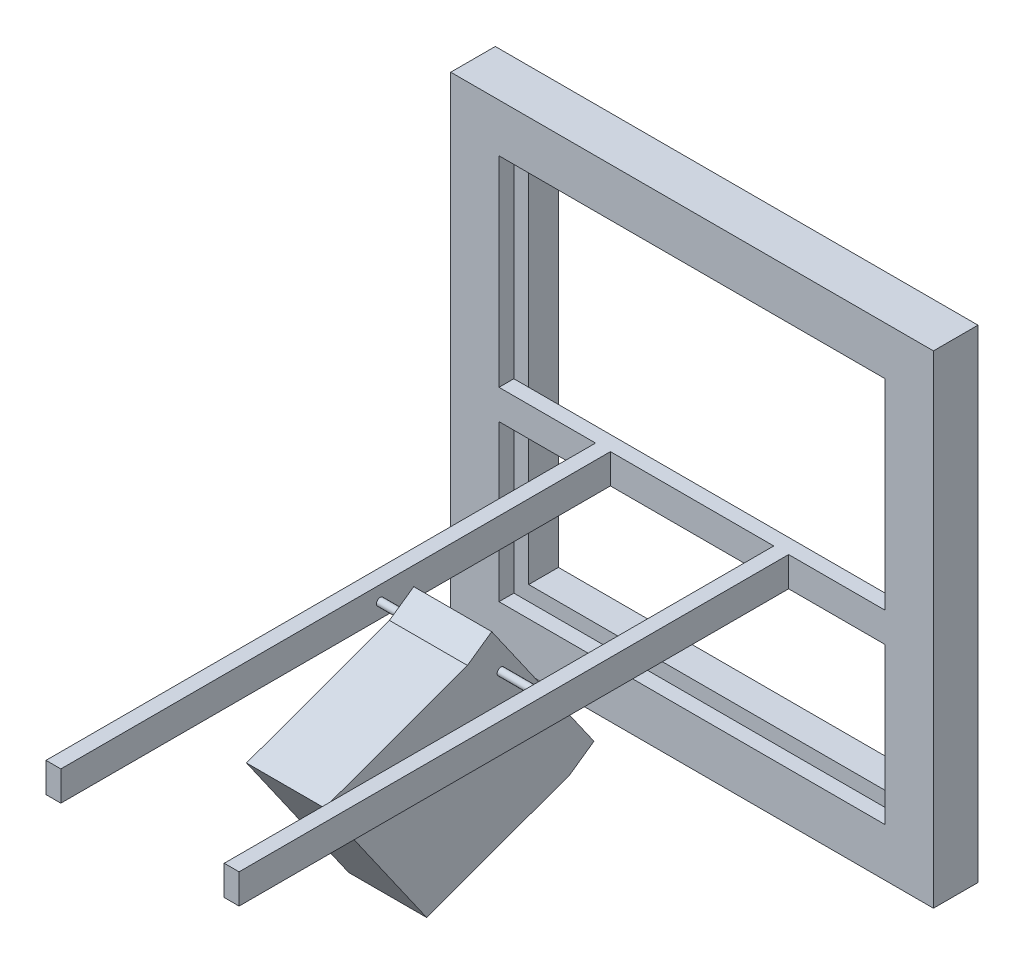
ISO-10303-21;
HEADER;
FILE_DESCRIPTION(('STEP AP214'),'2;1');
FILE_NAME('part.step','',(''),(''),'','','');
FILE_SCHEMA(('AUTOMOTIVE_DESIGN { 1 0 10303 214 1 1 1 1 }'));
ENDSEC;
DATA;
#1=APPLICATION_CONTEXT('core data for automotive mechanical design processes');
#2=APPLICATION_PROTOCOL_DEFINITION('international standard','automotive_design',2000,#1);
#3=PRODUCT_CONTEXT('',#1,'mechanical');
#4=PRODUCT('Part','Part','',(#3));
#5=PRODUCT_RELATED_PRODUCT_CATEGORY('part','',(#4));
#6=PRODUCT_DEFINITION_FORMATION('','',#4);
#7=PRODUCT_DEFINITION_CONTEXT('part definition',#1,'design');
#8=PRODUCT_DEFINITION('design','',#6,#7);
#9=PRODUCT_DEFINITION_SHAPE('','',#8);
#10=(LENGTH_UNIT() NAMED_UNIT(*) SI_UNIT(.MILLI.,.METRE.));
#11=(NAMED_UNIT(*) PLANE_ANGLE_UNIT() SI_UNIT($,.RADIAN.));
#12=(NAMED_UNIT(*) SI_UNIT($,.STERADIAN.) SOLID_ANGLE_UNIT());
#13=UNCERTAINTY_MEASURE_WITH_UNIT(LENGTH_MEASURE(1.E-05),#10,'distance_accuracy_value','');
#14=(GEOMETRIC_REPRESENTATION_CONTEXT(3) GLOBAL_UNCERTAINTY_ASSIGNED_CONTEXT((#13)) GLOBAL_UNIT_ASSIGNED_CONTEXT((#10,
#11,#12)) REPRESENTATION_CONTEXT('',''));
#15=CARTESIAN_POINT('',(0.,0.,0.));
#16=DIRECTION('',(0.,0.,1.));
#17=DIRECTION('',(1.,0.,0.));
#18=AXIS2_PLACEMENT_3D('',#15,#16,#17);
#19=CARTESIAN_POINT('',(186.944,292.1,469.9));
#20=DIRECTION('',(1.,0.,0.));
#21=DIRECTION('',(0.,0.,-1.));
#22=AXIS2_PLACEMENT_3D('',#19,#20,#21);
#23=CYLINDRICAL_SURFACE('',#22,6.34999999999994);
#24=CARTESIAN_POINT('',(469.9,292.1,469.9));
#25=DIRECTION('',(1.,0.,0.));
#26=DIRECTION('',(0.,0.,-1.));
#27=AXIS2_PLACEMENT_3D('',#24,#25,#26);
#28=CIRCLE('',#27,6.34999999999994);
#29=CARTESIAN_POINT('',(469.9,292.1,463.55));
#30=VERTEX_POINT('',#29);
#31=EDGE_CURVE('E367',#30,#30,#28,.F.);
#32=ORIENTED_EDGE('',*,*,#31,.T.);
#33=EDGE_LOOP('',(#32));
#34=FACE_BOUND('',#33,.T.);
#35=CARTESIAN_POINT('',(396.875,292.1,469.9));
#36=DIRECTION('',(-1.,0.,0.));
#37=DIRECTION('',(0.,0.,1.));
#38=AXIS2_PLACEMENT_3D('',#35,#36,#37);
#39=CIRCLE('',#38,6.34999999999994);
#40=CARTESIAN_POINT('',(396.875,292.1,476.25));
#41=VERTEX_POINT('',#40);
#42=EDGE_CURVE('E11',#41,#41,#39,.T.);
#43=ORIENTED_EDGE('',*,*,#42,.F.);
#44=EDGE_LOOP('',(#43));
#45=FACE_BOUND('',#44,.T.);
#46=ADVANCED_FACE('F41',(#34,#45),#23,.T.);
#47=CARTESIAN_POINT('',(0.,0.,76.2));
#48=DIRECTION('',(0.,0.,1.));
#49=DIRECTION('',(1.,0.,0.));
#50=AXIS2_PLACEMENT_3D('',#47,#48,#49);
#51=PLANE('',#50);
#52=DIRECTION('',(1.,0.,0.));
#53=VECTOR('',#52,1.);
#54=CARTESIAN_POINT('',(0.,266.7,76.2));
#55=LINE('',#54,#53);
#56=CARTESIAN_POINT('',(190.5,266.7,76.2));
#57=VERTEX_POINT('',#56);
#58=CARTESIAN_POINT('',(469.9,266.7,76.2));
#59=VERTEX_POINT('',#58);
#60=EDGE_CURVE('E423',#57,#59,#55,.T.);
#61=ORIENTED_EDGE('',*,*,#60,.T.);
#62=DIRECTION('',(0.,-1.,0.));
#63=VECTOR('',#62,1.);
#64=CARTESIAN_POINT('',(469.9,317.5,76.2));
#65=LINE('',#64,#63);
#66=CARTESIAN_POINT('',(469.9,317.5,76.2));
#67=VERTEX_POINT('',#66);
#68=EDGE_CURVE('E381',#67,#59,#65,.T.);
#69=ORIENTED_EDGE('',*,*,#68,.F.);
#70=DIRECTION('',(-1.,0.,0.));
#71=VECTOR('',#70,1.);
#72=CARTESIAN_POINT('',(0.,317.5,76.2));
#73=LINE('',#72,#71);
#74=CARTESIAN_POINT('',(190.5,317.5,76.2));
#75=VERTEX_POINT('',#74);
#76=EDGE_CURVE('E427',#67,#75,#73,.T.);
#77=ORIENTED_EDGE('',*,*,#76,.T.);
#78=DIRECTION('',(0.,1.,0.));
#79=VECTOR('',#78,1.);
#80=CARTESIAN_POINT('',(190.5,317.5,76.2));
#81=LINE('',#80,#79);
#82=EDGE_CURVE('E397',#57,#75,#81,.T.);
#83=ORIENTED_EDGE('',*,*,#82,.F.);
#84=EDGE_LOOP('',(#61,#69,#77,#83));
#85=FACE_BOUND('',#84,.T.);
#86=ADVANCED_FACE('F549',(#85),#51,.T.);
#87=DIRECTION('',(0.,-1.,0.));
#88=VECTOR('',#87,1.);
#89=CARTESIAN_POINT('',(165.1,317.5,76.2));
#90=LINE('',#89,#88);
#91=CARTESIAN_POINT('',(165.1,317.5,76.2));
#92=VERTEX_POINT('',#91);
#93=CARTESIAN_POINT('',(165.1,266.7,76.2));
#94=VERTEX_POINT('',#93);
#95=EDGE_CURVE('E385',#92,#94,#90,.T.);
#96=ORIENTED_EDGE('',*,*,#95,.F.);
#97=CARTESIAN_POINT('',(0.,317.5,76.2));
#98=VERTEX_POINT('',#97);
#99=EDGE_CURVE('E422',#92,#98,#73,.T.);
#100=ORIENTED_EDGE('',*,*,#99,.T.);
#101=DIRECTION('',(0.,-1.,0.));
#102=VECTOR('',#101,1.);
#103=CARTESIAN_POINT('',(0.,660.4,76.2));
#104=LINE('',#103,#102);
#105=CARTESIAN_POINT('',(0.,660.4,76.2));
#106=VERTEX_POINT('',#105);
#107=EDGE_CURVE('E259',#106,#98,#104,.T.);
#108=ORIENTED_EDGE('',*,*,#107,.F.);
#109=DIRECTION('',(-1.,0.,0.));
#110=VECTOR('',#109,1.);
#111=CARTESIAN_POINT('',(0.,660.4,76.2));
#112=LINE('',#111,#110);
#113=CARTESIAN_POINT('',(660.4,660.4,76.2));
#114=VERTEX_POINT('',#113);
#115=EDGE_CURVE('E279',#114,#106,#112,.T.);
#116=ORIENTED_EDGE('',*,*,#115,.F.);
#117=DIRECTION('',(0.,1.,0.));
#118=VECTOR('',#117,1.);
#119=CARTESIAN_POINT('',(660.4,660.4,76.2));
#120=LINE('',#119,#118);
#121=CARTESIAN_POINT('',(660.4,317.5,76.2));
#122=VERTEX_POINT('',#121);
#123=EDGE_CURVE('E275',#122,#114,#120,.T.);
#124=ORIENTED_EDGE('',*,*,#123,.F.);
#125=CARTESIAN_POINT('',(495.3,317.5,76.2));
#126=VERTEX_POINT('',#125);
#127=EDGE_CURVE('E56',#122,#126,#73,.T.);
#128=ORIENTED_EDGE('',*,*,#127,.T.);
#129=DIRECTION('',(0.,1.,0.));
#130=VECTOR('',#129,1.);
#131=CARTESIAN_POINT('',(495.3,317.5,76.2));
#132=LINE('',#131,#130);
#133=CARTESIAN_POINT('',(495.3,266.7,76.2));
#134=VERTEX_POINT('',#133);
#135=EDGE_CURVE('E60',#134,#126,#132,.T.);
#136=ORIENTED_EDGE('',*,*,#135,.F.);
#137=CARTESIAN_POINT('',(660.4,266.7,76.2));
#138=VERTEX_POINT('',#137);
#139=EDGE_CURVE('E424',#134,#138,#55,.T.);
#140=ORIENTED_EDGE('',*,*,#139,.T.);
#141=CARTESIAN_POINT('',(660.4,0.,76.2));
#142=VERTEX_POINT('',#141);
#143=EDGE_CURVE('E274',#142,#138,#120,.T.);
#144=ORIENTED_EDGE('',*,*,#143,.F.);
#145=DIRECTION('',(1.,0.,0.));
#146=VECTOR('',#145,1.);
#147=CARTESIAN_POINT('',(0.,0.,76.2));
#148=LINE('',#147,#146);
#149=CARTESIAN_POINT('',(0.,0.,76.2));
#150=VERTEX_POINT('',#149);
#151=EDGE_CURVE('E264',#150,#142,#148,.T.);
#152=ORIENTED_EDGE('',*,*,#151,.F.);
#153=CARTESIAN_POINT('',(0.,266.7,76.2));
#154=VERTEX_POINT('',#153);
#155=EDGE_CURVE('E250',#154,#150,#104,.T.);
#156=ORIENTED_EDGE('',*,*,#155,.F.);
#157=EDGE_CURVE('E420',#154,#94,#55,.T.);
#158=ORIENTED_EDGE('',*,*,#157,.T.);
#159=EDGE_LOOP('',(#96,#100,#108,#116,#124,#128,#136,#140,#144,#152,#156,#158));
#160=FACE_BOUND('',#159,.T.);
#161=DIRECTION('',(0.,-1.,0.));
#162=VECTOR('',#161,1.);
#163=CARTESIAN_POINT('',(-82.55,742.95,76.2));
#164=LINE('',#163,#162);
#165=CARTESIAN_POINT('',(-82.55,742.95,76.2));
#166=VERTEX_POINT('',#165);
#167=CARTESIAN_POINT('',(-82.55,-82.55,76.2));
#168=VERTEX_POINT('',#167);
#169=EDGE_CURVE('E288',#166,#168,#164,.T.);
#170=ORIENTED_EDGE('',*,*,#169,.T.);
#171=DIRECTION('',(1.,0.,0.));
#172=VECTOR('',#171,1.);
#173=CARTESIAN_POINT('',(-82.55,-82.55,76.2));
#174=LINE('',#173,#172);
#175=CARTESIAN_POINT('',(742.95,-82.55,76.2));
#176=VERTEX_POINT('',#175);
#177=EDGE_CURVE('E291',#168,#176,#174,.T.);
#178=ORIENTED_EDGE('',*,*,#177,.T.);
#179=DIRECTION('',(0.,1.,0.));
#180=VECTOR('',#179,1.);
#181=CARTESIAN_POINT('',(742.95,742.95,76.2));
#182=LINE('',#181,#180);
#183=CARTESIAN_POINT('',(742.95,742.95,76.2));
#184=VERTEX_POINT('',#183);
#185=EDGE_CURVE('E294',#176,#184,#182,.T.);
#186=ORIENTED_EDGE('',*,*,#185,.T.);
#187=DIRECTION('',(-1.,0.,0.));
#188=VECTOR('',#187,1.);
#189=CARTESIAN_POINT('',(-82.55,742.95,76.2));
#190=LINE('',#189,#188);
#191=EDGE_CURVE('E296',#184,#166,#190,.T.);
#192=ORIENTED_EDGE('',*,*,#191,.T.);
#193=EDGE_LOOP('',(#170,#178,#186,#192));
#194=FACE_BOUND('',#193,.T.);
#195=ADVANCED_FACE('F272',(#160,#194),#51,.T.);
#196=CARTESIAN_POINT('',(0.,0.,50.8));
#197=DIRECTION('',(0.,0.,-1.));
#198=DIRECTION('',(-1.,0.,0.));
#199=AXIS2_PLACEMENT_3D('',#196,#197,#198);
#200=PLANE('',#199);
#201=DIRECTION('',(-1.,0.,0.));
#202=VECTOR('',#201,1.);
#203=CARTESIAN_POINT('',(0.,317.5,50.8));
#204=LINE('',#203,#202);
#205=CARTESIAN_POINT('',(660.4,317.5,50.8));
#206=VERTEX_POINT('',#205);
#207=CARTESIAN_POINT('',(635.,317.5,50.8));
#208=VERTEX_POINT('',#207);
#209=EDGE_CURVE('E433',#206,#208,#204,.T.);
#210=ORIENTED_EDGE('',*,*,#209,.F.);
#211=DIRECTION('',(0.,1.,0.));
#212=VECTOR('',#211,1.);
#213=CARTESIAN_POINT('',(660.4,0.,50.8));
#214=LINE('',#213,#212);
#215=CARTESIAN_POINT('',(660.4,660.4,50.8));
#216=VERTEX_POINT('',#215);
#217=EDGE_CURVE('E485',#206,#216,#214,.T.);
#218=ORIENTED_EDGE('',*,*,#217,.T.);
#219=DIRECTION('',(-1.,0.,0.));
#220=VECTOR('',#219,1.);
#221=CARTESIAN_POINT('',(0.,660.4,50.8));
#222=LINE('',#221,#220);
#223=CARTESIAN_POINT('',(0.,660.4,50.8));
#224=VERTEX_POINT('',#223);
#225=EDGE_CURVE('E489',#216,#224,#222,.T.);
#226=ORIENTED_EDGE('',*,*,#225,.T.);
#227=DIRECTION('',(0.,-1.,0.));
#228=VECTOR('',#227,1.);
#229=CARTESIAN_POINT('',(0.,0.,50.8));
#230=LINE('',#229,#228);
#231=CARTESIAN_POINT('',(0.,317.5,50.8));
#232=VERTEX_POINT('',#231);
#233=EDGE_CURVE('E481',#224,#232,#230,.T.);
#234=ORIENTED_EDGE('',*,*,#233,.T.);
#235=CARTESIAN_POINT('',(25.4,317.5,50.8));
#236=VERTEX_POINT('',#235);
#237=EDGE_CURVE('E436',#236,#232,#204,.T.);
#238=ORIENTED_EDGE('',*,*,#237,.F.);
#239=DIRECTION('',(0.,-1.,0.));
#240=VECTOR('',#239,1.);
#241=CARTESIAN_POINT('',(25.4,25.4,50.8));
#242=LINE('',#241,#240);
#243=CARTESIAN_POINT('',(25.4,635.,50.8));
#244=VERTEX_POINT('',#243);
#245=EDGE_CURVE('E445',#244,#236,#242,.T.);
#246=ORIENTED_EDGE('',*,*,#245,.F.);
#247=DIRECTION('',(-1.,0.,0.));
#248=VECTOR('',#247,1.);
#249=CARTESIAN_POINT('',(25.4,635.,50.8));
#250=LINE('',#249,#248);
#251=CARTESIAN_POINT('',(635.,635.,50.8));
#252=VERTEX_POINT('',#251);
#253=EDGE_CURVE('E456',#252,#244,#250,.T.);
#254=ORIENTED_EDGE('',*,*,#253,.F.);
#255=DIRECTION('',(0.,1.,0.));
#256=VECTOR('',#255,1.);
#257=CARTESIAN_POINT('',(635.,25.4,50.8));
#258=LINE('',#257,#256);
#259=EDGE_CURVE('E452',#208,#252,#258,.T.);
#260=ORIENTED_EDGE('',*,*,#259,.F.);
#261=EDGE_LOOP('',(#210,#218,#226,#234,#238,#246,#254,#260));
#262=FACE_BOUND('',#261,.T.);
#263=ADVANCED_FACE('F534',(#262),#200,.F.);
#264=DIRECTION('',(1.,0.,0.));
#265=VECTOR('',#264,1.);
#266=CARTESIAN_POINT('',(0.,266.7,50.8));
#267=LINE('',#266,#265);
#268=CARTESIAN_POINT('',(0.,266.7,50.8));
#269=VERTEX_POINT('',#268);
#270=CARTESIAN_POINT('',(25.4,266.7,50.8));
#271=VERTEX_POINT('',#270);
#272=EDGE_CURVE('E428',#269,#271,#267,.T.);
#273=ORIENTED_EDGE('',*,*,#272,.F.);
#274=CARTESIAN_POINT('',(0.,0.,50.8));
#275=VERTEX_POINT('',#274);
#276=EDGE_CURVE('E480',#269,#275,#230,.T.);
#277=ORIENTED_EDGE('',*,*,#276,.T.);
#278=DIRECTION('',(1.,0.,0.));
#279=VECTOR('',#278,1.);
#280=CARTESIAN_POINT('',(0.,0.,50.8));
#281=LINE('',#280,#279);
#282=CARTESIAN_POINT('',(660.4,0.,50.8));
#283=VERTEX_POINT('',#282);
#284=EDGE_CURVE('E267',#275,#283,#281,.T.);
#285=ORIENTED_EDGE('',*,*,#284,.T.);
#286=CARTESIAN_POINT('',(660.4,266.7,50.8));
#287=VERTEX_POINT('',#286);
#288=EDGE_CURVE('E486',#283,#287,#214,.T.);
#289=ORIENTED_EDGE('',*,*,#288,.T.);
#290=CARTESIAN_POINT('',(635.,266.7,50.8));
#291=VERTEX_POINT('',#290);
#292=EDGE_CURVE('E432',#291,#287,#267,.T.);
#293=ORIENTED_EDGE('',*,*,#292,.F.);
#294=CARTESIAN_POINT('',(635.,25.4,50.8));
#295=VERTEX_POINT('',#294);
#296=EDGE_CURVE('E453',#295,#291,#258,.T.);
#297=ORIENTED_EDGE('',*,*,#296,.F.);
#298=DIRECTION('',(1.,0.,0.));
#299=VECTOR('',#298,1.);
#300=CARTESIAN_POINT('',(25.4,25.4,50.8));
#301=LINE('',#300,#299);
#302=CARTESIAN_POINT('',(25.4,25.4,50.8));
#303=VERTEX_POINT('',#302);
#304=EDGE_CURVE('E448',#303,#295,#301,.T.);
#305=ORIENTED_EDGE('',*,*,#304,.F.);
#306=EDGE_CURVE('E450',#271,#303,#242,.T.);
#307=ORIENTED_EDGE('',*,*,#306,.F.);
#308=EDGE_LOOP('',(#273,#277,#285,#289,#293,#297,#305,#307));
#309=FACE_BOUND('',#308,.T.);
#310=ADVANCED_FACE('F520',(#309),#200,.F.);
#311=CARTESIAN_POINT('',(0.,0.,0.));
#312=DIRECTION('',(0.,0.,-1.));
#313=DIRECTION('',(-1.,0.,0.));
#314=AXIS2_PLACEMENT_3D('',#311,#312,#313);
#315=PLANE('',#314);
#316=DIRECTION('',(-1.,0.,0.));
#317=VECTOR('',#316,1.);
#318=CARTESIAN_POINT('',(25.4,635.,0.));
#319=LINE('',#318,#317);
#320=CARTESIAN_POINT('',(635.,635.,0.));
#321=VERTEX_POINT('',#320);
#322=CARTESIAN_POINT('',(25.4,635.,0.));
#323=VERTEX_POINT('',#322);
#324=EDGE_CURVE('E468',#321,#323,#319,.T.);
#325=ORIENTED_EDGE('',*,*,#324,.T.);
#326=DIRECTION('',(0.,-1.,0.));
#327=VECTOR('',#326,1.);
#328=CARTESIAN_POINT('',(25.4,25.4,0.));
#329=LINE('',#328,#327);
#330=CARTESIAN_POINT('',(25.4,25.4,0.));
#331=VERTEX_POINT('',#330);
#332=EDGE_CURVE('E444',#323,#331,#329,.T.);
#333=ORIENTED_EDGE('',*,*,#332,.T.);
#334=DIRECTION('',(1.,0.,0.));
#335=VECTOR('',#334,1.);
#336=CARTESIAN_POINT('',(25.4,25.4,0.));
#337=LINE('',#336,#335);
#338=CARTESIAN_POINT('',(635.,25.4,0.));
#339=VERTEX_POINT('',#338);
#340=EDGE_CURVE('E462',#331,#339,#337,.T.);
#341=ORIENTED_EDGE('',*,*,#340,.T.);
#342=DIRECTION('',(0.,1.,0.));
#343=VECTOR('',#342,1.);
#344=CARTESIAN_POINT('',(635.,25.4,0.));
#345=LINE('',#344,#343);
#346=EDGE_CURVE('E465',#339,#321,#345,.T.);
#347=ORIENTED_EDGE('',*,*,#346,.T.);
#348=EDGE_LOOP('',(#325,#333,#341,#347));
#349=FACE_BOUND('',#348,.T.);
#350=DIRECTION('',(0.,-1.,0.));
#351=VECTOR('',#350,1.);
#352=CARTESIAN_POINT('',(-82.55,742.95,0.));
#353=LINE('',#352,#351);
#354=CARTESIAN_POINT('',(-82.55,742.95,0.));
#355=VERTEX_POINT('',#354);
#356=CARTESIAN_POINT('',(-82.55,-82.55,0.));
#357=VERTEX_POINT('',#356);
#358=EDGE_CURVE('E268',#355,#357,#353,.T.);
#359=ORIENTED_EDGE('',*,*,#358,.F.);
#360=DIRECTION('',(-1.,0.,0.));
#361=VECTOR('',#360,1.);
#362=CARTESIAN_POINT('',(-82.55,742.95,0.));
#363=LINE('',#362,#361);
#364=CARTESIAN_POINT('',(742.95,742.95,0.));
#365=VERTEX_POINT('',#364);
#366=EDGE_CURVE('E292',#365,#355,#363,.T.);
#367=ORIENTED_EDGE('',*,*,#366,.F.);
#368=DIRECTION('',(0.,1.,0.));
#369=VECTOR('',#368,1.);
#370=CARTESIAN_POINT('',(742.95,742.95,0.));
#371=LINE('',#370,#369);
#372=CARTESIAN_POINT('',(742.95,-82.55,0.));
#373=VERTEX_POINT('',#372);
#374=EDGE_CURVE('E303',#373,#365,#371,.T.);
#375=ORIENTED_EDGE('',*,*,#374,.F.);
#376=DIRECTION('',(1.,0.,0.));
#377=VECTOR('',#376,1.);
#378=CARTESIAN_POINT('',(-82.55,-82.55,0.));
#379=LINE('',#378,#377);
#380=EDGE_CURVE('E301',#357,#373,#379,.T.);
#381=ORIENTED_EDGE('',*,*,#380,.F.);
#382=EDGE_LOOP('',(#359,#367,#375,#381));
#383=FACE_BOUND('',#382,.T.);
#384=ADVANCED_FACE('F43',(#349,#383),#315,.T.);
#385=CARTESIAN_POINT('',(25.4,25.4,50.8));
#386=DIRECTION('',(1.,0.,0.));
#387=DIRECTION('',(0.,0.,-1.));
#388=AXIS2_PLACEMENT_3D('',#385,#386,#387);
#389=PLANE('',#388);
#390=ORIENTED_EDGE('',*,*,#332,.F.);
#391=DIRECTION('',(0.,0.,-1.));
#392=VECTOR('',#391,1.);
#393=CARTESIAN_POINT('',(25.4,635.,50.8));
#394=LINE('',#393,#392);
#395=EDGE_CURVE('E459',#244,#323,#394,.T.);
#396=ORIENTED_EDGE('',*,*,#395,.F.);
#397=ORIENTED_EDGE('',*,*,#245,.T.);
#398=EDGE_CURVE('E449',#236,#271,#242,.T.);
#399=ORIENTED_EDGE('',*,*,#398,.T.);
#400=ORIENTED_EDGE('',*,*,#306,.T.);
#401=DIRECTION('',(0.,0.,-1.));
#402=VECTOR('',#401,1.);
#403=CARTESIAN_POINT('',(25.4,25.4,50.8));
#404=LINE('',#403,#402);
#405=EDGE_CURVE('E477',#303,#331,#404,.T.);
#406=ORIENTED_EDGE('',*,*,#405,.T.);
#407=EDGE_LOOP('',(#390,#396,#397,#399,#400,#406));
#408=FACE_BOUND('',#407,.T.);
#409=ADVANCED_FACE('F512',(#408),#389,.T.);
#410=CARTESIAN_POINT('',(25.4,25.4,50.8));
#411=DIRECTION('',(0.,1.,0.));
#412=DIRECTION('',(0.,0.,1.));
#413=AXIS2_PLACEMENT_3D('',#410,#411,#412);
#414=PLANE('',#413);
#415=ORIENTED_EDGE('',*,*,#340,.F.);
#416=ORIENTED_EDGE('',*,*,#405,.F.);
#417=ORIENTED_EDGE('',*,*,#304,.T.);
#418=DIRECTION('',(0.,0.,-1.));
#419=VECTOR('',#418,1.);
#420=CARTESIAN_POINT('',(635.,25.4,50.8));
#421=LINE('',#420,#419);
#422=EDGE_CURVE('E475',#295,#339,#421,.T.);
#423=ORIENTED_EDGE('',*,*,#422,.T.);
#424=EDGE_LOOP('',(#415,#416,#417,#423));
#425=FACE_BOUND('',#424,.T.);
#426=ADVANCED_FACE('F517',(#425),#414,.T.);
#427=CARTESIAN_POINT('',(635.,25.4,50.8));
#428=DIRECTION('',(-1.,0.,0.));
#429=DIRECTION('',(0.,0.,1.));
#430=AXIS2_PLACEMENT_3D('',#427,#428,#429);
#431=PLANE('',#430);
#432=ORIENTED_EDGE('',*,*,#346,.F.);
#433=ORIENTED_EDGE('',*,*,#422,.F.);
#434=ORIENTED_EDGE('',*,*,#296,.T.);
#435=EDGE_CURVE('E457',#291,#208,#258,.T.);
#436=ORIENTED_EDGE('',*,*,#435,.T.);
#437=ORIENTED_EDGE('',*,*,#259,.T.);
#438=DIRECTION('',(0.,0.,-1.));
#439=VECTOR('',#438,1.);
#440=CARTESIAN_POINT('',(635.,635.,50.8));
#441=LINE('',#440,#439);
#442=EDGE_CURVE('E473',#252,#321,#441,.T.);
#443=ORIENTED_EDGE('',*,*,#442,.T.);
#444=EDGE_LOOP('',(#432,#433,#434,#436,#437,#443));
#445=FACE_BOUND('',#444,.T.);
#446=ADVANCED_FACE('F523',(#445),#431,.T.);
#447=CARTESIAN_POINT('',(25.4,635.,50.8));
#448=DIRECTION('',(0.,-1.,0.));
#449=DIRECTION('',(0.,0.,-1.));
#450=AXIS2_PLACEMENT_3D('',#447,#448,#449);
#451=PLANE('',#450);
#452=ORIENTED_EDGE('',*,*,#324,.F.);
#453=ORIENTED_EDGE('',*,*,#442,.F.);
#454=ORIENTED_EDGE('',*,*,#253,.T.);
#455=ORIENTED_EDGE('',*,*,#395,.T.);
#456=EDGE_LOOP('',(#452,#453,#454,#455));
#457=FACE_BOUND('',#456,.T.);
#458=ADVANCED_FACE('F531',(#457),#451,.T.);
#459=CARTESIAN_POINT('',(0.,266.7,76.2));
#460=DIRECTION('',(0.,1.,0.));
#461=DIRECTION('',(0.,0.,1.));
#462=AXIS2_PLACEMENT_3D('',#459,#460,#461);
#463=PLANE('',#462);
#464=ORIENTED_EDGE('',*,*,#272,.T.);
#465=EDGE_CURVE('E419',#271,#291,#267,.T.);
#466=ORIENTED_EDGE('',*,*,#465,.T.);
#467=ORIENTED_EDGE('',*,*,#292,.T.);
#468=DIRECTION('',(0.,0.,-1.));
#469=VECTOR('',#468,1.);
#470=CARTESIAN_POINT('',(660.4,266.7,76.2));
#471=LINE('',#470,#469);
#472=EDGE_CURVE('E441',#138,#287,#471,.T.);
#473=ORIENTED_EDGE('',*,*,#472,.F.);
#474=ORIENTED_EDGE('',*,*,#139,.F.);
#475=DIRECTION('',(0.,0.,-1.));
#476=VECTOR('',#475,1.);
#477=CARTESIAN_POINT('',(495.3,266.7,1016.));
#478=LINE('',#477,#476);
#479=CARTESIAN_POINT('',(495.3,266.7,1016.));
#480=VERTEX_POINT('',#479);
#481=EDGE_CURVE('E370',#480,#134,#478,.T.);
#482=ORIENTED_EDGE('',*,*,#481,.F.);
#483=DIRECTION('',(1.,0.,0.));
#484=VECTOR('',#483,1.);
#485=CARTESIAN_POINT('',(469.9,266.7,1016.));
#486=LINE('',#485,#484);
#487=CARTESIAN_POINT('',(469.9,266.7,1016.));
#488=VERTEX_POINT('',#487);
#489=EDGE_CURVE('E389',#488,#480,#486,.T.);
#490=ORIENTED_EDGE('',*,*,#489,.F.);
#491=DIRECTION('',(0.,0.,-1.));
#492=VECTOR('',#491,1.);
#493=CARTESIAN_POINT('',(469.9,266.7,1016.));
#494=LINE('',#493,#492);
#495=EDGE_CURVE('E364',#488,#59,#494,.T.);
#496=ORIENTED_EDGE('',*,*,#495,.T.);
#497=ORIENTED_EDGE('',*,*,#60,.F.);
#498=DIRECTION('',(0.,0.,-1.));
#499=VECTOR('',#498,1.);
#500=CARTESIAN_POINT('',(190.5,266.7,1016.));
#501=LINE('',#500,#499);
#502=CARTESIAN_POINT('',(190.5,266.7,1016.));
#503=VERTEX_POINT('',#502);
#504=EDGE_CURVE('E413',#503,#57,#501,.T.);
#505=ORIENTED_EDGE('',*,*,#504,.F.);
#506=DIRECTION('',(1.,0.,0.));
#507=VECTOR('',#506,1.);
#508=CARTESIAN_POINT('',(165.1,266.7,1016.));
#509=LINE('',#508,#507);
#510=CARTESIAN_POINT('',(165.1,266.7,1016.));
#511=VERTEX_POINT('',#510);
#512=EDGE_CURVE('E396',#511,#503,#509,.T.);
#513=ORIENTED_EDGE('',*,*,#512,.F.);
#514=DIRECTION('',(0.,0.,-1.));
#515=VECTOR('',#514,1.);
#516=CARTESIAN_POINT('',(165.1,266.7,1016.));
#517=LINE('',#516,#515);
#518=EDGE_CURVE('E416',#511,#94,#517,.T.);
#519=ORIENTED_EDGE('',*,*,#518,.T.);
#520=ORIENTED_EDGE('',*,*,#157,.F.);
#521=DIRECTION('',(0.,0.,-1.));
#522=VECTOR('',#521,1.);
#523=CARTESIAN_POINT('',(0.,266.7,76.2));
#524=LINE('',#523,#522);
#525=EDGE_CURVE('E256',#154,#269,#524,.T.);
#526=ORIENTED_EDGE('',*,*,#525,.T.);
#527=EDGE_LOOP('',(#464,#466,#467,#473,#474,#482,#490,#496,#497,#505,#513,#519,#520,#526));
#528=FACE_BOUND('',#527,.T.);
#529=ADVANCED_FACE('F563',(#528),#463,.F.);
#530=CARTESIAN_POINT('',(0.,317.5,76.2));
#531=DIRECTION('',(0.,-1.,0.));
#532=DIRECTION('',(0.,0.,-1.));
#533=AXIS2_PLACEMENT_3D('',#530,#531,#532);
#534=PLANE('',#533);
#535=ORIENTED_EDGE('',*,*,#209,.T.);
#536=EDGE_CURVE('E431',#208,#236,#204,.T.);
#537=ORIENTED_EDGE('',*,*,#536,.T.);
#538=ORIENTED_EDGE('',*,*,#237,.T.);
#539=DIRECTION('',(0.,0.,-1.));
#540=VECTOR('',#539,1.);
#541=CARTESIAN_POINT('',(0.,317.5,76.2));
#542=LINE('',#541,#540);
#543=EDGE_CURVE('E426',#98,#232,#542,.T.);
#544=ORIENTED_EDGE('',*,*,#543,.F.);
#545=ORIENTED_EDGE('',*,*,#99,.F.);
#546=DIRECTION('',(0.,0.,-1.));
#547=VECTOR('',#546,1.);
#548=CARTESIAN_POINT('',(165.1,317.5,1016.));
#549=LINE('',#548,#547);
#550=CARTESIAN_POINT('',(165.1,317.5,1016.));
#551=VERTEX_POINT('',#550);
#552=EDGE_CURVE('E403',#551,#92,#549,.T.);
#553=ORIENTED_EDGE('',*,*,#552,.F.);
#554=DIRECTION('',(-1.,0.,0.));
#555=VECTOR('',#554,1.);
#556=CARTESIAN_POINT('',(165.1,317.5,1016.));
#557=LINE('',#556,#555);
#558=CARTESIAN_POINT('',(190.5,317.5,1016.));
#559=VERTEX_POINT('',#558);
#560=EDGE_CURVE('E401',#559,#551,#557,.T.);
#561=ORIENTED_EDGE('',*,*,#560,.F.);
#562=DIRECTION('',(0.,0.,-1.));
#563=VECTOR('',#562,1.);
#564=CARTESIAN_POINT('',(190.5,317.5,1016.));
#565=LINE('',#564,#563);
#566=EDGE_CURVE('E410',#559,#75,#565,.T.);
#567=ORIENTED_EDGE('',*,*,#566,.T.);
#568=ORIENTED_EDGE('',*,*,#76,.F.);
#569=DIRECTION('',(0.,0.,-1.));
#570=VECTOR('',#569,1.);
#571=CARTESIAN_POINT('',(469.9,317.5,1016.));
#572=LINE('',#571,#570);
#573=CARTESIAN_POINT('',(469.9,317.5,1016.));
#574=VERTEX_POINT('',#573);
#575=EDGE_CURVE('E376',#574,#67,#572,.T.);
#576=ORIENTED_EDGE('',*,*,#575,.F.);
#577=DIRECTION('',(-1.,0.,0.));
#578=VECTOR('',#577,1.);
#579=CARTESIAN_POINT('',(469.9,317.5,1016.));
#580=LINE('',#579,#578);
#581=CARTESIAN_POINT('',(495.3,317.5,1016.));
#582=VERTEX_POINT('',#581);
#583=EDGE_CURVE('E379',#582,#574,#580,.T.);
#584=ORIENTED_EDGE('',*,*,#583,.F.);
#585=DIRECTION('',(0.,0.,-1.));
#586=VECTOR('',#585,1.);
#587=CARTESIAN_POINT('',(495.3,317.5,1016.));
#588=LINE('',#587,#586);
#589=EDGE_CURVE('E373',#582,#126,#588,.T.);
#590=ORIENTED_EDGE('',*,*,#589,.T.);
#591=ORIENTED_EDGE('',*,*,#127,.F.);
#592=DIRECTION('',(0.,0.,-1.));
#593=VECTOR('',#592,1.);
#594=CARTESIAN_POINT('',(660.4,317.5,76.2));
#595=LINE('',#594,#593);
#596=EDGE_CURVE('E438',#122,#206,#595,.T.);
#597=ORIENTED_EDGE('',*,*,#596,.T.);
#598=EDGE_LOOP('',(#535,#537,#538,#544,#545,#553,#561,#567,#568,#576,#584,#590,#591,#597));
#599=FACE_BOUND('',#598,.T.);
#600=ADVANCED_FACE('F500',(#599),#534,.F.);
#601=CARTESIAN_POINT('',(0.,0.,50.8));
#602=DIRECTION('',(0.,0.,1.));
#603=DIRECTION('',(1.,0.,0.));
#604=AXIS2_PLACEMENT_3D('',#601,#602,#603);
#605=PLANE('',#604);
#606=ORIENTED_EDGE('',*,*,#398,.F.);
#607=ORIENTED_EDGE('',*,*,#536,.F.);
#608=ORIENTED_EDGE('',*,*,#435,.F.);
#609=ORIENTED_EDGE('',*,*,#465,.F.);
#610=EDGE_LOOP('',(#606,#607,#608,#609));
#611=FACE_BOUND('',#610,.T.);
#612=ADVANCED_FACE('F505',(#611),#605,.F.);
#613=CARTESIAN_POINT('',(165.1,317.5,1016.));
#614=DIRECTION('',(1.,0.,0.));
#615=DIRECTION('',(0.,0.,-1.));
#616=AXIS2_PLACEMENT_3D('',#613,#614,#615);
#617=PLANE('',#616);
#618=ORIENTED_EDGE('',*,*,#95,.T.);
#619=ORIENTED_EDGE('',*,*,#518,.F.);
#620=DIRECTION('',(0.,-1.,0.));
#621=VECTOR('',#620,1.);
#622=CARTESIAN_POINT('',(165.1,317.5,1016.));
#623=LINE('',#622,#621);
#624=EDGE_CURVE('E393',#551,#511,#623,.T.);
#625=ORIENTED_EDGE('',*,*,#624,.F.);
#626=ORIENTED_EDGE('',*,*,#552,.T.);
#627=EDGE_LOOP('',(#618,#619,#625,#626));
#628=FACE_BOUND('',#627,.T.);
#629=ADVANCED_FACE('F570',(#628),#617,.F.);
#630=CARTESIAN_POINT('',(190.5,317.5,1016.));
#631=DIRECTION('',(-1.,0.,0.));
#632=DIRECTION('',(0.,0.,1.));
#633=AXIS2_PLACEMENT_3D('',#630,#631,#632);
#634=PLANE('',#633);
#635=CARTESIAN_POINT('',(190.5,292.1,469.9));
#636=DIRECTION('',(-1.,0.,0.));
#637=DIRECTION('',(0.,0.,1.));
#638=AXIS2_PLACEMENT_3D('',#635,#636,#637);
#639=CIRCLE('',#638,6.34999999999994);
#640=CARTESIAN_POINT('',(190.5,292.1,476.25));
#641=VERTEX_POINT('',#640);
#642=EDGE_CURVE('E49',#641,#641,#639,.F.);
#643=ORIENTED_EDGE('',*,*,#642,.F.);
#644=EDGE_LOOP('',(#643));
#645=FACE_BOUND('',#644,.T.);
#646=ORIENTED_EDGE('',*,*,#82,.T.);
#647=ORIENTED_EDGE('',*,*,#566,.F.);
#648=DIRECTION('',(0.,1.,0.));
#649=VECTOR('',#648,1.);
#650=CARTESIAN_POINT('',(190.5,317.5,1016.));
#651=LINE('',#650,#649);
#652=EDGE_CURVE('E399',#503,#559,#651,.T.);
#653=ORIENTED_EDGE('',*,*,#652,.F.);
#654=ORIENTED_EDGE('',*,*,#504,.T.);
#655=EDGE_LOOP('',(#646,#647,#653,#654));
#656=FACE_BOUND('',#655,.T.);
#657=ADVANCED_FACE('F554',(#645,#656),#634,.F.);
#658=CARTESIAN_POINT('',(0.,0.,1016.));
#659=DIRECTION('',(0.,0.,1.));
#660=DIRECTION('',(1.,0.,0.));
#661=AXIS2_PLACEMENT_3D('',#658,#659,#660);
#662=PLANE('',#661);
#663=ORIENTED_EDGE('',*,*,#624,.T.);
#664=ORIENTED_EDGE('',*,*,#512,.T.);
#665=ORIENTED_EDGE('',*,*,#652,.T.);
#666=ORIENTED_EDGE('',*,*,#560,.T.);
#667=EDGE_LOOP('',(#663,#664,#665,#666));
#668=FACE_BOUND('',#667,.T.);
#669=ADVANCED_FACE('F560',(#668),#662,.T.);
#670=CARTESIAN_POINT('',(469.9,317.5,1016.));
#671=DIRECTION('',(1.,0.,0.));
#672=DIRECTION('',(0.,0.,-1.));
#673=AXIS2_PLACEMENT_3D('',#670,#671,#672);
#674=PLANE('',#673);
#675=ORIENTED_EDGE('',*,*,#31,.F.);
#676=EDGE_LOOP('',(#675));
#677=FACE_BOUND('',#676,.T.);
#678=ORIENTED_EDGE('',*,*,#68,.T.);
#679=ORIENTED_EDGE('',*,*,#495,.F.);
#680=DIRECTION('',(0.,-1.,0.));
#681=VECTOR('',#680,1.);
#682=CARTESIAN_POINT('',(469.9,317.5,1016.));
#683=LINE('',#682,#681);
#684=EDGE_CURVE('E382',#574,#488,#683,.T.);
#685=ORIENTED_EDGE('',*,*,#684,.F.);
#686=ORIENTED_EDGE('',*,*,#575,.T.);
#687=EDGE_LOOP('',(#678,#679,#685,#686));
#688=FACE_BOUND('',#687,.T.);
#689=ADVANCED_FACE('F613',(#677,#688),#674,.F.);
#690=CARTESIAN_POINT('',(495.3,317.5,1016.));
#691=DIRECTION('',(-1.,0.,0.));
#692=DIRECTION('',(0.,0.,1.));
#693=AXIS2_PLACEMENT_3D('',#690,#691,#692);
#694=PLANE('',#693);
#695=ORIENTED_EDGE('',*,*,#135,.T.);
#696=ORIENTED_EDGE('',*,*,#589,.F.);
#697=DIRECTION('',(0.,1.,0.));
#698=VECTOR('',#697,1.);
#699=CARTESIAN_POINT('',(495.3,317.5,1016.));
#700=LINE('',#699,#698);
#701=EDGE_CURVE('E387',#480,#582,#700,.T.);
#702=ORIENTED_EDGE('',*,*,#701,.F.);
#703=ORIENTED_EDGE('',*,*,#481,.T.);
#704=EDGE_LOOP('',(#695,#696,#702,#703));
#705=FACE_BOUND('',#704,.T.);
#706=ADVANCED_FACE('F603',(#705),#694,.F.);
#707=CARTESIAN_POINT('',(0.,0.,1016.));
#708=DIRECTION('',(0.,0.,1.));
#709=DIRECTION('',(1.,0.,0.));
#710=AXIS2_PLACEMENT_3D('',#707,#708,#709);
#711=PLANE('',#710);
#712=ORIENTED_EDGE('',*,*,#684,.T.);
#713=ORIENTED_EDGE('',*,*,#489,.T.);
#714=ORIENTED_EDGE('',*,*,#701,.T.);
#715=ORIENTED_EDGE('',*,*,#583,.T.);
#716=EDGE_LOOP('',(#712,#713,#714,#715));
#717=FACE_BOUND('',#716,.T.);
#718=ADVANCED_FACE('F594',(#717),#711,.T.);
#719=CARTESIAN_POINT('',(263.525,292.1,469.9));
#720=DIRECTION('',(-1.,0.,0.));
#721=DIRECTION('',(0.,0.,1.));
#722=AXIS2_PLACEMENT_3D('',#719,#720,#721);
#723=CIRCLE('',#722,6.34999999999994);
#724=CARTESIAN_POINT('',(263.525,292.1,476.25));
#725=VERTEX_POINT('',#724);
#726=EDGE_CURVE('E317',#725,#725,#723,.T.);
#727=ORIENTED_EDGE('',*,*,#726,.T.);
#728=EDGE_LOOP('',(#727));
#729=FACE_BOUND('',#728,.T.);
#730=ORIENTED_EDGE('',*,*,#642,.T.);
#731=EDGE_LOOP('',(#730));
#732=FACE_BOUND('',#731,.T.);
#733=ADVANCED_FACE('F585',(#729,#732),#23,.T.);
#734=CARTESIAN_POINT('',(263.525,0.,0.));
#735=DIRECTION('',(-1.,0.,0.));
#736=DIRECTION('',(0.,0.,1.));
#737=AXIS2_PLACEMENT_3D('',#734,#735,#736);
#738=PLANE('',#737);
#739=DIRECTION('',(0.,0.573576436351048,-0.81915204428899));
#740=VECTOR('',#739,1.);
#741=CARTESIAN_POINT('',(263.525,329.547313329034,527.128565633232));
#742=LINE('',#741,#740);
#743=CARTESIAN_POINT('',(263.525,329.547313329034,527.128565633232));
#744=VERTEX_POINT('',#743);
#745=CARTESIAN_POINT('',(263.525,358.684996295667,485.515641783351));
#746=VERTEX_POINT('',#745);
#747=EDGE_CURVE('E321',#744,#746,#742,.T.);
#748=ORIENTED_EDGE('',*,*,#747,.T.);
#749=DIRECTION('',(0.,-0.819152044288991,-0.573576436351047));
#750=VECTOR('',#749,1.);
#751=CARTESIAN_POINT('',(263.525,358.684996295667,485.515641783351));
#752=LINE('',#751,#750);
#753=CARTESIAN_POINT('',(263.525,109.007453196383,310.689543983552));
#754=VERTEX_POINT('',#753);
#755=EDGE_CURVE('E324',#746,#754,#752,.T.);
#756=ORIENTED_EDGE('',*,*,#755,.T.);
#757=DIRECTION('',(0.,-0.573576436351048,0.81915204428899));
#758=VECTOR('',#757,1.);
#759=CARTESIAN_POINT('',(263.525,109.007453196383,310.689543983552));
#760=LINE('',#759,#758);
#761=CARTESIAN_POINT('',(263.525,79.8697702297499,352.302467833433));
#762=VERTEX_POINT('',#761);
#763=EDGE_CURVE('E327',#754,#762,#760,.T.);
#764=ORIENTED_EDGE('',*,*,#763,.T.);
#765=DIRECTION('',(0.,-0.342020143325672,0.939692620785907));
#766=VECTOR('',#765,1.);
#767=CARTESIAN_POINT('',(263.525,79.8697702297499,352.302467833433));
#768=LINE('',#767,#766);
#769=CARTESIAN_POINT('',(263.525,-9.08830096868399,596.712759729364));
#770=VERTEX_POINT('',#769);
#771=EDGE_CURVE('E329',#762,#770,#768,.T.);
#772=ORIENTED_EDGE('',*,*,#771,.T.);
#773=DIRECTION('',(0.,0.819152044288991,0.573576436351048));
#774=VECTOR('',#773,1.);
#775=CARTESIAN_POINT('',(263.525,-9.08830096868399,596.712759729364));
#776=LINE('',#775,#774);
#777=CARTESIAN_POINT('',(263.525,240.5892421306,771.538857529163));
#778=VERTEX_POINT('',#777);
#779=EDGE_CURVE('E331',#770,#778,#776,.T.);
#780=ORIENTED_EDGE('',*,*,#779,.T.);
#781=DIRECTION('',(0.,0.342020143325672,-0.939692620785907));
#782=VECTOR('',#781,1.);
#783=CARTESIAN_POINT('',(263.525,240.5892421306,771.538857529163));
#784=LINE('',#783,#782);
#785=EDGE_CURVE('E333',#778,#744,#784,.T.);
#786=ORIENTED_EDGE('',*,*,#785,.T.);
#787=EDGE_LOOP('',(#748,#756,#764,#772,#780,#786));
#788=FACE_BOUND('',#787,.T.);
#789=ORIENTED_EDGE('',*,*,#726,.F.);
#790=EDGE_LOOP('',(#789));
#791=FACE_BOUND('',#790,.T.);
#792=ADVANCED_FACE('F593',(#788,#791),#738,.T.);
#793=CARTESIAN_POINT('',(396.875,0.,0.));
#794=DIRECTION('',(-1.,0.,0.));
#795=DIRECTION('',(0.,0.,1.));
#796=AXIS2_PLACEMENT_3D('',#793,#794,#795);
#797=PLANE('',#796);
#798=DIRECTION('',(0.,0.573576436351048,-0.81915204428899));
#799=VECTOR('',#798,1.);
#800=CARTESIAN_POINT('',(396.875,329.547313329034,527.128565633232));
#801=LINE('',#800,#799);
#802=CARTESIAN_POINT('',(396.875,329.547313329034,527.128565633232));
#803=VERTEX_POINT('',#802);
#804=CARTESIAN_POINT('',(396.875,358.684996295667,485.515641783351));
#805=VERTEX_POINT('',#804);
#806=EDGE_CURVE('E320',#803,#805,#801,.T.);
#807=ORIENTED_EDGE('',*,*,#806,.F.);
#808=DIRECTION('',(0.,0.342020143325672,-0.939692620785907));
#809=VECTOR('',#808,1.);
#810=CARTESIAN_POINT('',(396.875,240.5892421306,771.538857529163));
#811=LINE('',#810,#809);
#812=CARTESIAN_POINT('',(396.875,240.5892421306,771.538857529163));
#813=VERTEX_POINT('',#812);
#814=EDGE_CURVE('E325',#813,#803,#811,.T.);
#815=ORIENTED_EDGE('',*,*,#814,.F.);
#816=DIRECTION('',(0.,0.819152044288991,0.573576436351048));
#817=VECTOR('',#816,1.);
#818=CARTESIAN_POINT('',(396.875,-9.08830096868399,596.712759729364));
#819=LINE('',#818,#817);
#820=CARTESIAN_POINT('',(396.875,-9.08830096868399,596.712759729364));
#821=VERTEX_POINT('',#820);
#822=EDGE_CURVE('E344',#821,#813,#819,.T.);
#823=ORIENTED_EDGE('',*,*,#822,.F.);
#824=DIRECTION('',(0.,-0.342020143325672,0.939692620785907));
#825=VECTOR('',#824,1.);
#826=CARTESIAN_POINT('',(396.875,79.8697702297499,352.302467833433));
#827=LINE('',#826,#825);
#828=CARTESIAN_POINT('',(396.875,79.8697702297499,352.302467833433));
#829=VERTEX_POINT('',#828);
#830=EDGE_CURVE('E342',#829,#821,#827,.T.);
#831=ORIENTED_EDGE('',*,*,#830,.F.);
#832=DIRECTION('',(0.,-0.573576436351048,0.81915204428899));
#833=VECTOR('',#832,1.);
#834=CARTESIAN_POINT('',(396.875,109.007453196383,310.689543983552));
#835=LINE('',#834,#833);
#836=CARTESIAN_POINT('',(396.875,109.007453196383,310.689543983552));
#837=VERTEX_POINT('',#836);
#838=EDGE_CURVE('E340',#837,#829,#835,.T.);
#839=ORIENTED_EDGE('',*,*,#838,.F.);
#840=DIRECTION('',(0.,-0.819152044288991,-0.573576436351047));
#841=VECTOR('',#840,1.);
#842=CARTESIAN_POINT('',(396.875,358.684996295667,485.515641783351));
#843=LINE('',#842,#841);
#844=EDGE_CURVE('E338',#805,#837,#843,.T.);
#845=ORIENTED_EDGE('',*,*,#844,.F.);
#846=EDGE_LOOP('',(#807,#815,#823,#831,#839,#845));
#847=FACE_BOUND('',#846,.T.);
#848=ORIENTED_EDGE('',*,*,#42,.T.);
#849=EDGE_LOOP('',(#848));
#850=FACE_BOUND('',#849,.T.);
#851=ADVANCED_FACE('F600',(#847,#850),#797,.F.);
#852=CARTESIAN_POINT('',(263.525,329.547313329034,527.128565633232));
#853=DIRECTION('',(0.,-0.81915204428899,-0.573576436351048));
#854=DIRECTION('',(0.,0.573576436351048,-0.81915204428899));
#855=AXIS2_PLACEMENT_3D('',#852,#853,#854);
#856=PLANE('',#855);
#857=ORIENTED_EDGE('',*,*,#806,.T.);
#858=DIRECTION('',(1.,0.,0.));
#859=VECTOR('',#858,1.);
#860=CARTESIAN_POINT('',(263.525,358.684996295667,485.515641783351));
#861=LINE('',#860,#859);
#862=EDGE_CURVE('E361',#746,#805,#861,.T.);
#863=ORIENTED_EDGE('',*,*,#862,.F.);
#864=ORIENTED_EDGE('',*,*,#747,.F.);
#865=DIRECTION('',(1.,0.,0.));
#866=VECTOR('',#865,1.);
#867=CARTESIAN_POINT('',(263.525,329.547313329034,527.128565633232));
#868=LINE('',#867,#866);
#869=EDGE_CURVE('E335',#744,#803,#868,.T.);
#870=ORIENTED_EDGE('',*,*,#869,.T.);
#871=EDGE_LOOP('',(#857,#863,#864,#870));
#872=FACE_BOUND('',#871,.T.);
#873=ADVANCED_FACE('F659',(#872),#856,.F.);
#874=CARTESIAN_POINT('',(263.525,358.684996295667,485.515641783351));
#875=DIRECTION('',(0.,-0.573576436351047,0.819152044288991));
#876=DIRECTION('',(0.,-0.819152044288991,-0.573576436351047));
#877=AXIS2_PLACEMENT_3D('',#874,#875,#876);
#878=PLANE('',#877);
#879=ORIENTED_EDGE('',*,*,#844,.T.);
#880=DIRECTION('',(1.,0.,0.));
#881=VECTOR('',#880,1.);
#882=CARTESIAN_POINT('',(263.525,109.007453196383,310.689543983552));
#883=LINE('',#882,#881);
#884=EDGE_CURVE('E358',#754,#837,#883,.T.);
#885=ORIENTED_EDGE('',*,*,#884,.F.);
#886=ORIENTED_EDGE('',*,*,#755,.F.);
#887=ORIENTED_EDGE('',*,*,#862,.T.);
#888=EDGE_LOOP('',(#879,#885,#886,#887));
#889=FACE_BOUND('',#888,.T.);
#890=ADVANCED_FACE('F675',(#889),#878,.F.);
#891=CARTESIAN_POINT('',(263.525,109.007453196383,310.689543983552));
#892=DIRECTION('',(0.,0.81915204428899,0.573576436351048));
#893=DIRECTION('',(0.,-0.573576436351048,0.81915204428899));
#894=AXIS2_PLACEMENT_3D('',#891,#892,#893);
#895=PLANE('',#894);
#896=ORIENTED_EDGE('',*,*,#838,.T.);
#897=DIRECTION('',(1.,0.,0.));
#898=VECTOR('',#897,1.);
#899=CARTESIAN_POINT('',(263.525,79.8697702297499,352.302467833433));
#900=LINE('',#899,#898);
#901=EDGE_CURVE('E355',#762,#829,#900,.T.);
#902=ORIENTED_EDGE('',*,*,#901,.F.);
#903=ORIENTED_EDGE('',*,*,#763,.F.);
#904=ORIENTED_EDGE('',*,*,#884,.T.);
#905=EDGE_LOOP('',(#896,#902,#903,#904));
#906=FACE_BOUND('',#905,.T.);
#907=ADVANCED_FACE('F671',(#906),#895,.F.);
#908=CARTESIAN_POINT('',(263.525,79.8697702297499,352.302467833433));
#909=DIRECTION('',(0.,0.939692620785907,0.342020143325672));
#910=DIRECTION('',(0.,-0.342020143325672,0.939692620785907));
#911=AXIS2_PLACEMENT_3D('',#908,#909,#910);
#912=PLANE('',#911);
#913=ORIENTED_EDGE('',*,*,#830,.T.);
#914=DIRECTION('',(1.,0.,0.));
#915=VECTOR('',#914,1.);
#916=CARTESIAN_POINT('',(263.525,-9.08830096868399,596.712759729364));
#917=LINE('',#916,#915);
#918=EDGE_CURVE('E352',#770,#821,#917,.T.);
#919=ORIENTED_EDGE('',*,*,#918,.F.);
#920=ORIENTED_EDGE('',*,*,#771,.F.);
#921=ORIENTED_EDGE('',*,*,#901,.T.);
#922=EDGE_LOOP('',(#913,#919,#920,#921));
#923=FACE_BOUND('',#922,.T.);
#924=ADVANCED_FACE('F667',(#923),#912,.F.);
#925=CARTESIAN_POINT('',(263.525,-9.08830096868399,596.712759729364));
#926=DIRECTION('',(0.,0.573576436351048,-0.819152044288991));
#927=DIRECTION('',(0.,0.819152044288991,0.573576436351048));
#928=AXIS2_PLACEMENT_3D('',#925,#926,#927);
#929=PLANE('',#928);
#930=ORIENTED_EDGE('',*,*,#822,.T.);
#931=DIRECTION('',(1.,0.,0.));
#932=VECTOR('',#931,1.);
#933=CARTESIAN_POINT('',(263.525,240.5892421306,771.538857529163));
#934=LINE('',#933,#932);
#935=EDGE_CURVE('E349',#778,#813,#934,.T.);
#936=ORIENTED_EDGE('',*,*,#935,.F.);
#937=ORIENTED_EDGE('',*,*,#779,.F.);
#938=ORIENTED_EDGE('',*,*,#918,.T.);
#939=EDGE_LOOP('',(#930,#936,#937,#938));
#940=FACE_BOUND('',#939,.T.);
#941=ADVANCED_FACE('F663',(#940),#929,.F.);
#942=CARTESIAN_POINT('',(263.525,240.5892421306,771.538857529163));
#943=DIRECTION('',(0.,-0.939692620785907,-0.342020143325672));
#944=DIRECTION('',(0.,0.342020143325672,-0.939692620785907));
#945=AXIS2_PLACEMENT_3D('',#942,#943,#944);
#946=PLANE('',#945);
#947=ORIENTED_EDGE('',*,*,#814,.T.);
#948=ORIENTED_EDGE('',*,*,#869,.F.);
#949=ORIENTED_EDGE('',*,*,#785,.F.);
#950=ORIENTED_EDGE('',*,*,#935,.T.);
#951=EDGE_LOOP('',(#947,#948,#949,#950));
#952=FACE_BOUND('',#951,.T.);
#953=ADVANCED_FACE('F643',(#952),#946,.F.);
#954=CARTESIAN_POINT('',(0.,0.,76.2));
#955=DIRECTION('',(0.,1.,0.));
#956=DIRECTION('',(0.,0.,1.));
#957=AXIS2_PLACEMENT_3D('',#954,#955,#956);
#958=PLANE('',#957);
#959=ORIENTED_EDGE('',*,*,#284,.F.);
#960=DIRECTION('',(0.,0.,-1.));
#961=VECTOR('',#960,1.);
#962=CARTESIAN_POINT('',(0.,0.,76.2));
#963=LINE('',#962,#961);
#964=EDGE_CURVE('E253',#150,#275,#963,.T.);
#965=ORIENTED_EDGE('',*,*,#964,.F.);
#966=ORIENTED_EDGE('',*,*,#151,.T.);
#967=DIRECTION('',(0.,0.,-1.));
#968=VECTOR('',#967,1.);
#969=CARTESIAN_POINT('',(660.4,0.,76.2));
#970=LINE('',#969,#968);
#971=EDGE_CURVE('E269',#142,#283,#970,.T.);
#972=ORIENTED_EDGE('',*,*,#971,.T.);
#973=EDGE_LOOP('',(#959,#965,#966,#972));
#974=FACE_BOUND('',#973,.T.);
#975=ADVANCED_FACE('F262',(#974),#958,.T.);
#976=CARTESIAN_POINT('',(0.,660.4,76.2));
#977=DIRECTION('',(0.,-1.,0.));
#978=DIRECTION('',(0.,0.,-1.));
#979=AXIS2_PLACEMENT_3D('',#976,#977,#978);
#980=PLANE('',#979);
#981=ORIENTED_EDGE('',*,*,#225,.F.);
#982=DIRECTION('',(0.,0.,-1.));
#983=VECTOR('',#982,1.);
#984=CARTESIAN_POINT('',(660.4,660.4,76.2));
#985=LINE('',#984,#983);
#986=EDGE_CURVE('E284',#114,#216,#985,.T.);
#987=ORIENTED_EDGE('',*,*,#986,.F.);
#988=ORIENTED_EDGE('',*,*,#115,.T.);
#989=DIRECTION('',(0.,0.,-1.));
#990=VECTOR('',#989,1.);
#991=CARTESIAN_POINT('',(0.,660.4,76.2));
#992=LINE('',#991,#990);
#993=EDGE_CURVE('E281',#106,#224,#992,.T.);
#994=ORIENTED_EDGE('',*,*,#993,.T.);
#995=EDGE_LOOP('',(#981,#987,#988,#994));
#996=FACE_BOUND('',#995,.T.);
#997=ADVANCED_FACE('F541',(#996),#980,.T.);
#998=CARTESIAN_POINT('',(0.,660.4,76.2));
#999=DIRECTION('',(1.,0.,0.));
#1000=DIRECTION('',(0.,0.,-1.));
#1001=AXIS2_PLACEMENT_3D('',#998,#999,#1000);
#1002=PLANE('',#1001);
#1003=ORIENTED_EDGE('',*,*,#276,.F.);
#1004=ORIENTED_EDGE('',*,*,#525,.F.);
#1005=ORIENTED_EDGE('',*,*,#155,.T.);
#1006=ORIENTED_EDGE('',*,*,#964,.T.);
#1007=EDGE_LOOP('',(#1003,#1004,#1005,#1006));
#1008=FACE_BOUND('',#1007,.T.);
#1009=ADVANCED_FACE('F252',(#1008),#1002,.T.);
#1010=ORIENTED_EDGE('',*,*,#233,.F.);
#1011=ORIENTED_EDGE('',*,*,#993,.F.);
#1012=ORIENTED_EDGE('',*,*,#107,.T.);
#1013=ORIENTED_EDGE('',*,*,#543,.T.);
#1014=EDGE_LOOP('',(#1010,#1011,#1012,#1013));
#1015=FACE_BOUND('',#1014,.T.);
#1016=ADVANCED_FACE('F538',(#1015),#1002,.T.);
#1017=CARTESIAN_POINT('',(660.4,660.4,76.2));
#1018=DIRECTION('',(-1.,0.,0.));
#1019=DIRECTION('',(0.,0.,1.));
#1020=AXIS2_PLACEMENT_3D('',#1017,#1018,#1019);
#1021=PLANE('',#1020);
#1022=ORIENTED_EDGE('',*,*,#288,.F.);
#1023=ORIENTED_EDGE('',*,*,#971,.F.);
#1024=ORIENTED_EDGE('',*,*,#143,.T.);
#1025=ORIENTED_EDGE('',*,*,#472,.T.);
#1026=EDGE_LOOP('',(#1022,#1023,#1024,#1025));
#1027=FACE_BOUND('',#1026,.T.);
#1028=ADVANCED_FACE('F568',(#1027),#1021,.T.);
#1029=ORIENTED_EDGE('',*,*,#217,.F.);
#1030=ORIENTED_EDGE('',*,*,#596,.F.);
#1031=ORIENTED_EDGE('',*,*,#123,.T.);
#1032=ORIENTED_EDGE('',*,*,#986,.T.);
#1033=EDGE_LOOP('',(#1029,#1030,#1031,#1032));
#1034=FACE_BOUND('',#1033,.T.);
#1035=ADVANCED_FACE('F628',(#1034),#1021,.T.);
#1036=CARTESIAN_POINT('',(-82.55,742.95,76.2));
#1037=DIRECTION('',(1.,0.,0.));
#1038=DIRECTION('',(0.,0.,-1.));
#1039=AXIS2_PLACEMENT_3D('',#1036,#1037,#1038);
#1040=PLANE('',#1039);
#1041=ORIENTED_EDGE('',*,*,#358,.T.);
#1042=DIRECTION('',(0.,0.,-1.));
#1043=VECTOR('',#1042,1.);
#1044=CARTESIAN_POINT('',(-82.55,-82.55,76.2));
#1045=LINE('',#1044,#1043);
#1046=EDGE_CURVE('E314',#168,#357,#1045,.T.);
#1047=ORIENTED_EDGE('',*,*,#1046,.F.);
#1048=ORIENTED_EDGE('',*,*,#169,.F.);
#1049=DIRECTION('',(0.,0.,-1.));
#1050=VECTOR('',#1049,1.);
#1051=CARTESIAN_POINT('',(-82.55,742.95,76.2));
#1052=LINE('',#1051,#1050);
#1053=EDGE_CURVE('E298',#166,#355,#1052,.T.);
#1054=ORIENTED_EDGE('',*,*,#1053,.T.);
#1055=EDGE_LOOP('',(#1041,#1047,#1048,#1054));
#1056=FACE_BOUND('',#1055,.T.);
#1057=ADVANCED_FACE('F630',(#1056),#1040,.F.);
#1058=CARTESIAN_POINT('',(-82.55,-82.55,76.2));
#1059=DIRECTION('',(0.,1.,0.));
#1060=DIRECTION('',(-1.,0.,0.));
#1061=AXIS2_PLACEMENT_3D('',#1058,#1059,#1060);
#1062=PLANE('',#1061);
#1063=ORIENTED_EDGE('',*,*,#380,.T.);
#1064=DIRECTION('',(0.,0.,-1.));
#1065=VECTOR('',#1064,1.);
#1066=CARTESIAN_POINT('',(742.95,-82.55,76.2));
#1067=LINE('',#1066,#1065);
#1068=EDGE_CURVE('E311',#176,#373,#1067,.T.);
#1069=ORIENTED_EDGE('',*,*,#1068,.F.);
#1070=ORIENTED_EDGE('',*,*,#177,.F.);
#1071=ORIENTED_EDGE('',*,*,#1046,.T.);
#1072=EDGE_LOOP('',(#1063,#1069,#1070,#1071));
#1073=FACE_BOUND('',#1072,.T.);
#1074=ADVANCED_FACE('F636',(#1073),#1062,.F.);
#1075=CARTESIAN_POINT('',(742.95,742.95,76.2));
#1076=DIRECTION('',(-1.,0.,0.));
#1077=DIRECTION('',(0.,0.,1.));
#1078=AXIS2_PLACEMENT_3D('',#1075,#1076,#1077);
#1079=PLANE('',#1078);
#1080=ORIENTED_EDGE('',*,*,#374,.T.);
#1081=DIRECTION('',(0.,0.,-1.));
#1082=VECTOR('',#1081,1.);
#1083=CARTESIAN_POINT('',(742.95,742.95,76.2));
#1084=LINE('',#1083,#1082);
#1085=EDGE_CURVE('E308',#184,#365,#1084,.T.);
#1086=ORIENTED_EDGE('',*,*,#1085,.F.);
#1087=ORIENTED_EDGE('',*,*,#185,.F.);
#1088=ORIENTED_EDGE('',*,*,#1068,.T.);
#1089=EDGE_LOOP('',(#1080,#1086,#1087,#1088));
#1090=FACE_BOUND('',#1089,.T.);
#1091=ADVANCED_FACE('F649',(#1090),#1079,.F.);
#1092=CARTESIAN_POINT('',(-82.55,742.95,76.2));
#1093=DIRECTION('',(0.,-1.,0.));
#1094=DIRECTION('',(0.,0.,-1.));
#1095=AXIS2_PLACEMENT_3D('',#1092,#1093,#1094);
#1096=PLANE('',#1095);
#1097=ORIENTED_EDGE('',*,*,#366,.T.);
#1098=ORIENTED_EDGE('',*,*,#1053,.F.);
#1099=ORIENTED_EDGE('',*,*,#191,.F.);
#1100=ORIENTED_EDGE('',*,*,#1085,.T.);
#1101=EDGE_LOOP('',(#1097,#1098,#1099,#1100));
#1102=FACE_BOUND('',#1101,.T.);
#1103=ADVANCED_FACE('F646',(#1102),#1096,.F.);
#1104=CLOSED_SHELL('',(#46,#86,#195,#263,#310,#384,#409,#426,#446,#458,#529,#600,#612,#629,#657,
#669,#689,#706,#718,#733,#792,#851,#873,#890,#907,#924,#941,#953,#975,#997,#1009,#1016,#1028,
#1035,#1057,#1074,#1091,#1103));
#1105=MANIFOLD_SOLID_BREP('B2',#1104);
#1106=ADVANCED_BREP_SHAPE_REPRESENTATION('',(#18,#1105),#14);
#1107=SHAPE_DEFINITION_REPRESENTATION(#9,#1106);
ENDSEC;
END-ISO-10303-21;
